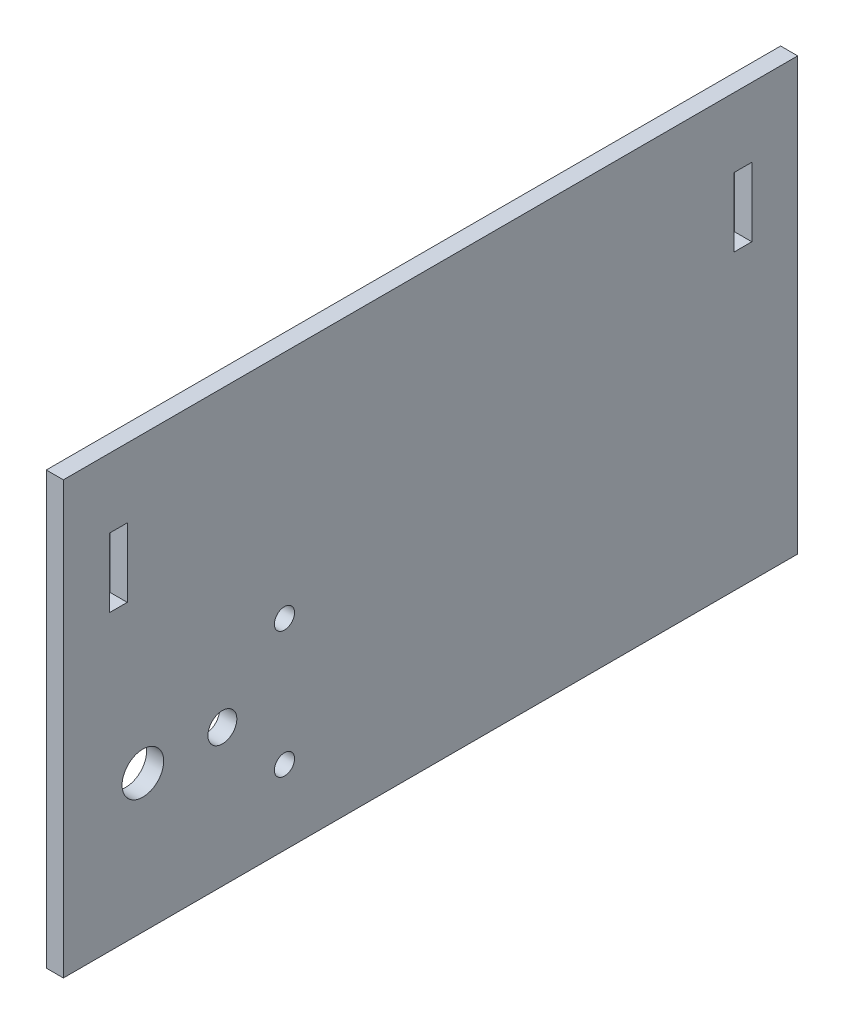
ISO-10303-21;
HEADER;
FILE_DESCRIPTION(('STEP AP214'),'2;1');
FILE_NAME('part.step','',(''),(''),'','','');
FILE_SCHEMA(('AUTOMOTIVE_DESIGN { 1 0 10303 214 1 1 1 1 }'));
ENDSEC;
DATA;
#1=APPLICATION_CONTEXT('core data for automotive mechanical design processes');
#2=APPLICATION_PROTOCOL_DEFINITION('international standard','automotive_design',2000,#1);
#3=PRODUCT_CONTEXT('',#1,'mechanical');
#4=PRODUCT('Part','Part','',(#3));
#5=PRODUCT_RELATED_PRODUCT_CATEGORY('part','',(#4));
#6=PRODUCT_DEFINITION_FORMATION('','',#4);
#7=PRODUCT_DEFINITION_CONTEXT('part definition',#1,'design');
#8=PRODUCT_DEFINITION('design','',#6,#7);
#9=PRODUCT_DEFINITION_SHAPE('','',#8);
#10=(LENGTH_UNIT() NAMED_UNIT(*) SI_UNIT(.MILLI.,.METRE.));
#11=(NAMED_UNIT(*) PLANE_ANGLE_UNIT() SI_UNIT($,.RADIAN.));
#12=(NAMED_UNIT(*) SI_UNIT($,.STERADIAN.) SOLID_ANGLE_UNIT());
#13=UNCERTAINTY_MEASURE_WITH_UNIT(LENGTH_MEASURE(1.E-05),#10,'distance_accuracy_value','');
#14=(GEOMETRIC_REPRESENTATION_CONTEXT(3) GLOBAL_UNCERTAINTY_ASSIGNED_CONTEXT((#13)) GLOBAL_UNIT_ASSIGNED_CONTEXT((#10,
#11,#12)) REPRESENTATION_CONTEXT('',''));
#15=CARTESIAN_POINT('',(0.,0.,0.));
#16=DIRECTION('',(0.,0.,1.));
#17=DIRECTION('',(1.,0.,0.));
#18=AXIS2_PLACEMENT_3D('',#15,#16,#17);
#19=CARTESIAN_POINT('',(2.3622,0.,0.));
#20=DIRECTION('',(0.,0.,-1.));
#21=DIRECTION('',(-1.,0.,0.));
#22=AXIS2_PLACEMENT_3D('',#19,#20,#21);
#23=PLANE('',#22);
#24=DIRECTION('',(0.,-1.,0.));
#25=VECTOR('',#24,1.);
#26=CARTESIAN_POINT('',(0.,0.,0.));
#27=LINE('',#26,#25);
#28=CARTESIAN_POINT('',(0.,59.69,0.));
#29=VERTEX_POINT('',#28);
#30=CARTESIAN_POINT('',(0.,0.,0.));
#31=VERTEX_POINT('',#30);
#32=EDGE_CURVE('E213',#29,#31,#27,.T.);
#33=ORIENTED_EDGE('',*,*,#32,.T.);
#34=DIRECTION('',(-1.,0.,0.));
#35=VECTOR('',#34,1.);
#36=CARTESIAN_POINT('',(2.3622,0.,0.));
#37=LINE('',#36,#35);
#38=CARTESIAN_POINT('',(2.3622,0.,0.));
#39=VERTEX_POINT('',#38);
#40=EDGE_CURVE('E11',#39,#31,#37,.T.);
#41=ORIENTED_EDGE('',*,*,#40,.F.);
#42=DIRECTION('',(0.,-1.,0.));
#43=VECTOR('',#42,1.);
#44=CARTESIAN_POINT('',(2.3622,0.,0.));
#45=LINE('',#44,#43);
#46=CARTESIAN_POINT('',(2.3622,59.69,0.));
#47=VERTEX_POINT('',#46);
#48=EDGE_CURVE('E216',#47,#39,#45,.T.);
#49=ORIENTED_EDGE('',*,*,#48,.F.);
#50=DIRECTION('',(-1.,0.,0.));
#51=VECTOR('',#50,1.);
#52=CARTESIAN_POINT('',(2.3622,59.69,0.));
#53=LINE('',#52,#51);
#54=EDGE_CURVE('E226',#47,#29,#53,.T.);
#55=ORIENTED_EDGE('',*,*,#54,.T.);
#56=EDGE_LOOP('',(#33,#41,#49,#55));
#57=FACE_BOUND('',#56,.T.);
#58=ADVANCED_FACE('F35',(#57),#23,.F.);
#59=CARTESIAN_POINT('',(2.3622,0.,0.));
#60=DIRECTION('',(0.,1.,0.));
#61=DIRECTION('',(0.,0.,1.));
#62=AXIS2_PLACEMENT_3D('',#59,#60,#61);
#63=PLANE('',#62);
#64=DIRECTION('',(0.,0.,-1.));
#65=VECTOR('',#64,1.);
#66=CARTESIAN_POINT('',(0.,0.,0.));
#67=LINE('',#66,#65);
#68=CARTESIAN_POINT('',(0.,0.,-101.6));
#69=VERTEX_POINT('',#68);
#70=EDGE_CURVE('E229',#31,#69,#67,.T.);
#71=ORIENTED_EDGE('',*,*,#70,.T.);
#72=DIRECTION('',(-1.,0.,0.));
#73=VECTOR('',#72,1.);
#74=CARTESIAN_POINT('',(2.3622,0.,-101.6));
#75=LINE('',#74,#73);
#76=CARTESIAN_POINT('',(2.3622,0.,-101.6));
#77=VERTEX_POINT('',#76);
#78=EDGE_CURVE('E42',#77,#69,#75,.T.);
#79=ORIENTED_EDGE('',*,*,#78,.F.);
#80=DIRECTION('',(0.,0.,-1.));
#81=VECTOR('',#80,1.);
#82=CARTESIAN_POINT('',(2.3622,0.,0.));
#83=LINE('',#82,#81);
#84=EDGE_CURVE('E219',#39,#77,#83,.T.);
#85=ORIENTED_EDGE('',*,*,#84,.F.);
#86=ORIENTED_EDGE('',*,*,#40,.T.);
#87=EDGE_LOOP('',(#71,#79,#85,#86));
#88=FACE_BOUND('',#87,.T.);
#89=ADVANCED_FACE('F258',(#88),#63,.F.);
#90=CARTESIAN_POINT('',(2.3622,0.,-101.6));
#91=DIRECTION('',(0.,0.,1.));
#92=DIRECTION('',(1.,0.,0.));
#93=AXIS2_PLACEMENT_3D('',#90,#91,#92);
#94=PLANE('',#93);
#95=DIRECTION('',(0.,1.,0.));
#96=VECTOR('',#95,1.);
#97=CARTESIAN_POINT('',(0.,0.,-101.6));
#98=LINE('',#97,#96);
#99=CARTESIAN_POINT('',(0.,59.69,-101.6));
#100=VERTEX_POINT('',#99);
#101=EDGE_CURVE('E231',#69,#100,#98,.T.);
#102=ORIENTED_EDGE('',*,*,#101,.T.);
#103=DIRECTION('',(-1.,0.,0.));
#104=VECTOR('',#103,1.);
#105=CARTESIAN_POINT('',(2.3622,59.69,-101.6));
#106=LINE('',#105,#104);
#107=CARTESIAN_POINT('',(2.3622,59.69,-101.6));
#108=VERTEX_POINT('',#107);
#109=EDGE_CURVE('E236',#108,#100,#106,.T.);
#110=ORIENTED_EDGE('',*,*,#109,.F.);
#111=DIRECTION('',(0.,1.,0.));
#112=VECTOR('',#111,1.);
#113=CARTESIAN_POINT('',(2.3622,0.,-101.6));
#114=LINE('',#113,#112);
#115=EDGE_CURVE('E222',#77,#108,#114,.T.);
#116=ORIENTED_EDGE('',*,*,#115,.F.);
#117=ORIENTED_EDGE('',*,*,#78,.T.);
#118=EDGE_LOOP('',(#102,#110,#116,#117));
#119=FACE_BOUND('',#118,.T.);
#120=ADVANCED_FACE('F243',(#119),#94,.F.);
#121=CARTESIAN_POINT('',(2.3622,59.69,0.));
#122=DIRECTION('',(0.,-1.,0.));
#123=DIRECTION('',(0.,0.,-1.));
#124=AXIS2_PLACEMENT_3D('',#121,#122,#123);
#125=PLANE('',#124);
#126=DIRECTION('',(0.,0.,1.));
#127=VECTOR('',#126,1.);
#128=CARTESIAN_POINT('',(0.,59.69,0.));
#129=LINE('',#128,#127);
#130=EDGE_CURVE('E220',#100,#29,#129,.T.);
#131=ORIENTED_EDGE('',*,*,#130,.T.);
#132=ORIENTED_EDGE('',*,*,#54,.F.);
#133=DIRECTION('',(0.,0.,1.));
#134=VECTOR('',#133,1.);
#135=CARTESIAN_POINT('',(2.3622,59.69,0.));
#136=LINE('',#135,#134);
#137=EDGE_CURVE('E224',#108,#47,#136,.T.);
#138=ORIENTED_EDGE('',*,*,#137,.F.);
#139=ORIENTED_EDGE('',*,*,#109,.T.);
#140=EDGE_LOOP('',(#131,#132,#138,#139));
#141=FACE_BOUND('',#140,.T.);
#142=ADVANCED_FACE('F251',(#141),#125,.F.);
#143=CARTESIAN_POINT('',(2.3622,0.,0.));
#144=DIRECTION('',(-1.,0.,0.));
#145=DIRECTION('',(0.,0.,1.));
#146=AXIS2_PLACEMENT_3D('',#143,#144,#145);
#147=PLANE('',#146);
#148=DIRECTION('',(0.,-1.,0.));
#149=VECTOR('',#148,1.);
#150=CARTESIAN_POINT('',(2.3622,50.1142,-92.7608));
#151=LINE('',#150,#149);
#152=CARTESIAN_POINT('',(2.3622,50.1142,-92.7608));
#153=VERTEX_POINT('',#152);
#154=CARTESIAN_POINT('',(2.3622,40.5892,-92.7608));
#155=VERTEX_POINT('',#154);
#156=EDGE_CURVE('E150',#153,#155,#151,.T.);
#157=ORIENTED_EDGE('',*,*,#156,.F.);
#158=DIRECTION('',(0.,0.,1.));
#159=VECTOR('',#158,1.);
#160=CARTESIAN_POINT('',(2.3622,50.1142,-95.25));
#161=LINE('',#160,#159);
#162=CARTESIAN_POINT('',(2.3622,50.1142,-95.25));
#163=VERTEX_POINT('',#162);
#164=EDGE_CURVE('E49',#163,#153,#161,.T.);
#165=ORIENTED_EDGE('',*,*,#164,.F.);
#166=DIRECTION('',(0.,1.,0.));
#167=VECTOR('',#166,1.);
#168=CARTESIAN_POINT('',(2.3622,50.1142,-95.25));
#169=LINE('',#168,#167);
#170=CARTESIAN_POINT('',(2.3622,40.5892,-95.25));
#171=VERTEX_POINT('',#170);
#172=EDGE_CURVE('E141',#171,#163,#169,.T.);
#173=ORIENTED_EDGE('',*,*,#172,.F.);
#174=DIRECTION('',(0.,0.,-1.));
#175=VECTOR('',#174,1.);
#176=CARTESIAN_POINT('',(2.3622,40.5892,-95.25));
#177=LINE('',#176,#175);
#178=EDGE_CURVE('E144',#155,#171,#177,.T.);
#179=ORIENTED_EDGE('',*,*,#178,.F.);
#180=EDGE_LOOP('',(#157,#165,#173,#179));
#181=FACE_BOUND('',#180,.T.);
#182=DIRECTION('',(0.,0.,-1.));
#183=VECTOR('',#182,1.);
#184=CARTESIAN_POINT('',(2.3622,40.5892,-6.35));
#185=LINE('',#184,#183);
#186=CARTESIAN_POINT('',(2.3622,40.5892,-6.35));
#187=VERTEX_POINT('',#186);
#188=CARTESIAN_POINT('',(2.3622,40.5892,-8.8392));
#189=VERTEX_POINT('',#188);
#190=EDGE_CURVE('E175',#187,#189,#185,.T.);
#191=ORIENTED_EDGE('',*,*,#190,.F.);
#192=DIRECTION('',(0.,-1.,0.));
#193=VECTOR('',#192,1.);
#194=CARTESIAN_POINT('',(2.3622,50.1142,-6.35));
#195=LINE('',#194,#193);
#196=CARTESIAN_POINT('',(2.3622,50.1142,-6.35));
#197=VERTEX_POINT('',#196);
#198=EDGE_CURVE('E156',#197,#187,#195,.T.);
#199=ORIENTED_EDGE('',*,*,#198,.F.);
#200=DIRECTION('',(0.,0.,1.));
#201=VECTOR('',#200,1.);
#202=CARTESIAN_POINT('',(2.3622,50.1142,-6.35));
#203=LINE('',#202,#201);
#204=CARTESIAN_POINT('',(2.3622,50.1142,-8.8392));
#205=VERTEX_POINT('',#204);
#206=EDGE_CURVE('E164',#205,#197,#203,.T.);
#207=ORIENTED_EDGE('',*,*,#206,.F.);
#208=DIRECTION('',(0.,1.,0.));
#209=VECTOR('',#208,1.);
#210=CARTESIAN_POINT('',(2.3622,50.1142,-8.8392));
#211=LINE('',#210,#209);
#212=EDGE_CURVE('E178',#189,#205,#211,.T.);
#213=ORIENTED_EDGE('',*,*,#212,.F.);
#214=EDGE_LOOP('',(#191,#199,#207,#213));
#215=FACE_BOUND('',#214,.T.);
#216=CARTESIAN_POINT('',(2.3622,19.05,-11.));
#217=DIRECTION('',(1.,0.,0.));
#218=DIRECTION('',(0.,0.,1.));
#219=AXIS2_PLACEMENT_3D('',#216,#217,#218);
#220=CIRCLE('',#219,2.87699996099999);
#221=CARTESIAN_POINT('',(2.3622,19.05,-8.12300003899999));
#222=VERTEX_POINT('',#221);
#223=EDGE_CURVE('E192',#222,#222,#220,.T.);
#224=ORIENTED_EDGE('',*,*,#223,.F.);
#225=EDGE_LOOP('',(#224));
#226=FACE_BOUND('',#225,.T.);
#227=CARTESIAN_POINT('',(2.3622,19.05,-22.0000034));
#228=DIRECTION('',(1.,0.,0.));
#229=DIRECTION('',(0.,0.,1.));
#230=AXIS2_PLACEMENT_3D('',#227,#228,#229);
#231=CIRCLE('',#230,1.99999999999998);
#232=CARTESIAN_POINT('',(2.3622,19.05,-20.0000034));
#233=VERTEX_POINT('',#232);
#234=EDGE_CURVE('E198',#233,#233,#231,.T.);
#235=ORIENTED_EDGE('',*,*,#234,.F.);
#236=EDGE_LOOP('',(#235));
#237=FACE_BOUND('',#236,.T.);
#238=CARTESIAN_POINT('',(2.3622,27.8,-30.59102));
#239=DIRECTION('',(1.,0.,0.));
#240=DIRECTION('',(0.,0.,1.));
#241=AXIS2_PLACEMENT_3D('',#238,#239,#240);
#242=CIRCLE('',#241,1.39999999999999);
#243=CARTESIAN_POINT('',(2.3622,27.8,-29.19102));
#244=VERTEX_POINT('',#243);
#245=EDGE_CURVE('E204',#244,#244,#242,.T.);
#246=ORIENTED_EDGE('',*,*,#245,.F.);
#247=EDGE_LOOP('',(#246));
#248=FACE_BOUND('',#247,.T.);
#249=CARTESIAN_POINT('',(2.3622,10.3,-30.59102));
#250=DIRECTION('',(1.,0.,0.));
#251=DIRECTION('',(0.,0.,1.));
#252=AXIS2_PLACEMENT_3D('',#249,#250,#251);
#253=CIRCLE('',#252,1.39999999999999);
#254=CARTESIAN_POINT('',(2.3622,10.3,-29.19102));
#255=VERTEX_POINT('',#254);
#256=EDGE_CURVE('E210',#255,#255,#253,.T.);
#257=ORIENTED_EDGE('',*,*,#256,.F.);
#258=EDGE_LOOP('',(#257));
#259=FACE_BOUND('',#258,.T.);
#260=ORIENTED_EDGE('',*,*,#48,.T.);
#261=ORIENTED_EDGE('',*,*,#84,.T.);
#262=ORIENTED_EDGE('',*,*,#115,.T.);
#263=ORIENTED_EDGE('',*,*,#137,.T.);
#264=EDGE_LOOP('',(#260,#261,#262,#263));
#265=FACE_BOUND('',#264,.T.);
#266=ADVANCED_FACE('F257',(#181,#215,#226,#237,#248,#259,#265),#147,.F.);
#267=CARTESIAN_POINT('',(0.,0.,0.));
#268=DIRECTION('',(-1.,0.,0.));
#269=DIRECTION('',(0.,0.,1.));
#270=AXIS2_PLACEMENT_3D('',#267,#268,#269);
#271=PLANE('',#270);
#272=DIRECTION('',(0.,0.,1.));
#273=VECTOR('',#272,1.);
#274=CARTESIAN_POINT('',(0.,50.1142,-95.25));
#275=LINE('',#274,#273);
#276=CARTESIAN_POINT('',(0.,50.1142,-95.25));
#277=VERTEX_POINT('',#276);
#278=CARTESIAN_POINT('',(0.,50.1142,-92.7608));
#279=VERTEX_POINT('',#278);
#280=EDGE_CURVE('E125',#277,#279,#275,.T.);
#281=ORIENTED_EDGE('',*,*,#280,.T.);
#282=DIRECTION('',(0.,-1.,0.));
#283=VECTOR('',#282,1.);
#284=CARTESIAN_POINT('',(0.,50.1142,-92.7608));
#285=LINE('',#284,#283);
#286=CARTESIAN_POINT('',(0.,40.5892,-92.7608));
#287=VERTEX_POINT('',#286);
#288=EDGE_CURVE('E134',#279,#287,#285,.T.);
#289=ORIENTED_EDGE('',*,*,#288,.T.);
#290=DIRECTION('',(0.,0.,-1.));
#291=VECTOR('',#290,1.);
#292=CARTESIAN_POINT('',(0.,40.5892,-95.25));
#293=LINE('',#292,#291);
#294=CARTESIAN_POINT('',(0.,40.5892,-95.25));
#295=VERTEX_POINT('',#294);
#296=EDGE_CURVE('E57',#287,#295,#293,.T.);
#297=ORIENTED_EDGE('',*,*,#296,.T.);
#298=DIRECTION('',(0.,1.,0.));
#299=VECTOR('',#298,1.);
#300=CARTESIAN_POINT('',(0.,50.1142,-95.25));
#301=LINE('',#300,#299);
#302=EDGE_CURVE('E131',#295,#277,#301,.T.);
#303=ORIENTED_EDGE('',*,*,#302,.T.);
#304=EDGE_LOOP('',(#281,#289,#297,#303));
#305=FACE_BOUND('',#304,.T.);
#306=DIRECTION('',(0.,-1.,0.));
#307=VECTOR('',#306,1.);
#308=CARTESIAN_POINT('',(0.,50.1142,-6.35));
#309=LINE('',#308,#307);
#310=CARTESIAN_POINT('',(0.,50.1142,-6.35));
#311=VERTEX_POINT('',#310);
#312=CARTESIAN_POINT('',(0.,40.5892,-6.35));
#313=VERTEX_POINT('',#312);
#314=EDGE_CURVE('E160',#311,#313,#309,.T.);
#315=ORIENTED_EDGE('',*,*,#314,.T.);
#316=DIRECTION('',(0.,0.,-1.));
#317=VECTOR('',#316,1.);
#318=CARTESIAN_POINT('',(0.,40.5892,-6.35));
#319=LINE('',#318,#317);
#320=CARTESIAN_POINT('',(0.,40.5892,-8.8392));
#321=VERTEX_POINT('',#320);
#322=EDGE_CURVE('E163',#313,#321,#319,.T.);
#323=ORIENTED_EDGE('',*,*,#322,.T.);
#324=DIRECTION('',(0.,1.,0.));
#325=VECTOR('',#324,1.);
#326=CARTESIAN_POINT('',(0.,50.1142,-8.8392));
#327=LINE('',#326,#325);
#328=CARTESIAN_POINT('',(0.,50.1142,-8.8392));
#329=VERTEX_POINT('',#328);
#330=EDGE_CURVE('E167',#321,#329,#327,.T.);
#331=ORIENTED_EDGE('',*,*,#330,.T.);
#332=DIRECTION('',(0.,0.,1.));
#333=VECTOR('',#332,1.);
#334=CARTESIAN_POINT('',(0.,50.1142,-6.35));
#335=LINE('',#334,#333);
#336=EDGE_CURVE('E170',#329,#311,#335,.T.);
#337=ORIENTED_EDGE('',*,*,#336,.T.);
#338=EDGE_LOOP('',(#315,#323,#331,#337));
#339=FACE_BOUND('',#338,.T.);
#340=CARTESIAN_POINT('',(0.,19.05,-11.));
#341=DIRECTION('',(-1.,0.,0.));
#342=DIRECTION('',(0.,0.,1.));
#343=AXIS2_PLACEMENT_3D('',#340,#341,#342);
#344=CIRCLE('',#343,2.87699996099999);
#345=CARTESIAN_POINT('',(0.,19.05,-8.12300003899999));
#346=VERTEX_POINT('',#345);
#347=EDGE_CURVE('E185',#346,#346,#344,.F.);
#348=ORIENTED_EDGE('',*,*,#347,.T.);
#349=EDGE_LOOP('',(#348));
#350=FACE_BOUND('',#349,.T.);
#351=CARTESIAN_POINT('',(0.,19.05,-22.0000034));
#352=DIRECTION('',(-1.,0.,0.));
#353=DIRECTION('',(0.,0.,1.));
#354=AXIS2_PLACEMENT_3D('',#351,#352,#353);
#355=CIRCLE('',#354,1.99999999999998);
#356=CARTESIAN_POINT('',(0.,19.05,-20.0000034));
#357=VERTEX_POINT('',#356);
#358=EDGE_CURVE('E195',#357,#357,#355,.F.);
#359=ORIENTED_EDGE('',*,*,#358,.T.);
#360=EDGE_LOOP('',(#359));
#361=FACE_BOUND('',#360,.T.);
#362=CARTESIAN_POINT('',(0.,27.8,-30.59102));
#363=DIRECTION('',(-1.,0.,0.));
#364=DIRECTION('',(0.,0.,1.));
#365=AXIS2_PLACEMENT_3D('',#362,#363,#364);
#366=CIRCLE('',#365,1.39999999999999);
#367=CARTESIAN_POINT('',(0.,27.8,-29.19102));
#368=VERTEX_POINT('',#367);
#369=EDGE_CURVE('E201',#368,#368,#366,.F.);
#370=ORIENTED_EDGE('',*,*,#369,.T.);
#371=EDGE_LOOP('',(#370));
#372=FACE_BOUND('',#371,.T.);
#373=CARTESIAN_POINT('',(0.,10.3,-30.59102));
#374=DIRECTION('',(-1.,0.,0.));
#375=DIRECTION('',(0.,0.,1.));
#376=AXIS2_PLACEMENT_3D('',#373,#374,#375);
#377=CIRCLE('',#376,1.39999999999999);
#378=CARTESIAN_POINT('',(0.,10.3,-29.19102));
#379=VERTEX_POINT('',#378);
#380=EDGE_CURVE('E207',#379,#379,#377,.F.);
#381=ORIENTED_EDGE('',*,*,#380,.T.);
#382=EDGE_LOOP('',(#381));
#383=FACE_BOUND('',#382,.T.);
#384=ORIENTED_EDGE('',*,*,#32,.F.);
#385=ORIENTED_EDGE('',*,*,#130,.F.);
#386=ORIENTED_EDGE('',*,*,#101,.F.);
#387=ORIENTED_EDGE('',*,*,#70,.F.);
#388=EDGE_LOOP('',(#384,#385,#386,#387));
#389=FACE_BOUND('',#388,.T.);
#390=ADVANCED_FACE('F138',(#305,#339,#350,#361,#372,#383,#389),#271,.T.);
#391=CARTESIAN_POINT('',(-0.00100000000000013,10.3,-30.59102));
#392=DIRECTION('',(1.,0.,0.));
#393=DIRECTION('',(0.,0.,-1.));
#394=AXIS2_PLACEMENT_3D('',#391,#392,#393);
#395=CYLINDRICAL_SURFACE('',#394,1.39999999999999);
#396=ORIENTED_EDGE('',*,*,#380,.F.);
#397=EDGE_LOOP('',(#396));
#398=FACE_BOUND('',#397,.T.);
#399=ORIENTED_EDGE('',*,*,#256,.T.);
#400=EDGE_LOOP('',(#399));
#401=FACE_BOUND('',#400,.T.);
#402=ADVANCED_FACE('F270',(#398,#401),#395,.F.);
#403=CARTESIAN_POINT('',(-0.00100000000000013,27.8,-30.59102));
#404=DIRECTION('',(1.,0.,0.));
#405=DIRECTION('',(0.,0.,-1.));
#406=AXIS2_PLACEMENT_3D('',#403,#404,#405);
#407=CYLINDRICAL_SURFACE('',#406,1.39999999999999);
#408=ORIENTED_EDGE('',*,*,#369,.F.);
#409=EDGE_LOOP('',(#408));
#410=FACE_BOUND('',#409,.T.);
#411=ORIENTED_EDGE('',*,*,#245,.T.);
#412=EDGE_LOOP('',(#411));
#413=FACE_BOUND('',#412,.T.);
#414=ADVANCED_FACE('F276',(#410,#413),#407,.F.);
#415=CARTESIAN_POINT('',(-0.00100000000000013,19.05,-22.0000034));
#416=DIRECTION('',(1.,0.,0.));
#417=DIRECTION('',(0.,0.,-1.));
#418=AXIS2_PLACEMENT_3D('',#415,#416,#417);
#419=CYLINDRICAL_SURFACE('',#418,1.99999999999998);
#420=ORIENTED_EDGE('',*,*,#358,.F.);
#421=EDGE_LOOP('',(#420));
#422=FACE_BOUND('',#421,.T.);
#423=ORIENTED_EDGE('',*,*,#234,.T.);
#424=EDGE_LOOP('',(#423));
#425=FACE_BOUND('',#424,.T.);
#426=ADVANCED_FACE('F280',(#422,#425),#419,.F.);
#427=CARTESIAN_POINT('',(-0.00100000000000013,19.05,-11.));
#428=DIRECTION('',(1.,0.,0.));
#429=DIRECTION('',(0.,0.,-1.));
#430=AXIS2_PLACEMENT_3D('',#427,#428,#429);
#431=CYLINDRICAL_SURFACE('',#430,2.87699996099999);
#432=ORIENTED_EDGE('',*,*,#347,.F.);
#433=EDGE_LOOP('',(#432));
#434=FACE_BOUND('',#433,.T.);
#435=ORIENTED_EDGE('',*,*,#223,.T.);
#436=EDGE_LOOP('',(#435));
#437=FACE_BOUND('',#436,.T.);
#438=ADVANCED_FACE('F284',(#434,#437),#431,.F.);
#439=CARTESIAN_POINT('',(0.,50.1142,-6.35));
#440=DIRECTION('',(0.,0.,1.));
#441=DIRECTION('',(0.,-1.,0.));
#442=AXIS2_PLACEMENT_3D('',#439,#440,#441);
#443=PLANE('',#442);
#444=ORIENTED_EDGE('',*,*,#198,.T.);
#445=DIRECTION('',(1.,0.,0.));
#446=VECTOR('',#445,1.);
#447=CARTESIAN_POINT('',(0.,40.5892,-6.35));
#448=LINE('',#447,#446);
#449=EDGE_CURVE('E173',#313,#187,#448,.T.);
#450=ORIENTED_EDGE('',*,*,#449,.F.);
#451=ORIENTED_EDGE('',*,*,#314,.F.);
#452=DIRECTION('',(1.,0.,0.));
#453=VECTOR('',#452,1.);
#454=CARTESIAN_POINT('',(0.,50.1142,-6.35));
#455=LINE('',#454,#453);
#456=EDGE_CURVE('E183',#311,#197,#455,.T.);
#457=ORIENTED_EDGE('',*,*,#456,.T.);
#458=EDGE_LOOP('',(#444,#450,#451,#457));
#459=FACE_BOUND('',#458,.T.);
#460=ADVANCED_FACE('F288',(#459),#443,.F.);
#461=CARTESIAN_POINT('',(0.,50.1142,-6.35));
#462=DIRECTION('',(0.,1.,0.));
#463=DIRECTION('',(0.,0.,1.));
#464=AXIS2_PLACEMENT_3D('',#461,#462,#463);
#465=PLANE('',#464);
#466=ORIENTED_EDGE('',*,*,#206,.T.);
#467=ORIENTED_EDGE('',*,*,#456,.F.);
#468=ORIENTED_EDGE('',*,*,#336,.F.);
#469=DIRECTION('',(1.,0.,0.));
#470=VECTOR('',#469,1.);
#471=CARTESIAN_POINT('',(0.,50.1142,-8.8392));
#472=LINE('',#471,#470);
#473=EDGE_CURVE('E186',#329,#205,#472,.T.);
#474=ORIENTED_EDGE('',*,*,#473,.T.);
#475=EDGE_LOOP('',(#466,#467,#468,#474));
#476=FACE_BOUND('',#475,.T.);
#477=ADVANCED_FACE('F292',(#476),#465,.F.);
#478=CARTESIAN_POINT('',(0.,50.1142,-8.8392));
#479=DIRECTION('',(0.,0.,-1.));
#480=DIRECTION('',(0.,1.,0.));
#481=AXIS2_PLACEMENT_3D('',#478,#479,#480);
#482=PLANE('',#481);
#483=ORIENTED_EDGE('',*,*,#212,.T.);
#484=ORIENTED_EDGE('',*,*,#473,.F.);
#485=ORIENTED_EDGE('',*,*,#330,.F.);
#486=DIRECTION('',(1.,0.,0.));
#487=VECTOR('',#486,1.);
#488=CARTESIAN_POINT('',(0.,40.5892,-8.8392));
#489=LINE('',#488,#487);
#490=EDGE_CURVE('E188',#321,#189,#489,.T.);
#491=ORIENTED_EDGE('',*,*,#490,.T.);
#492=EDGE_LOOP('',(#483,#484,#485,#491));
#493=FACE_BOUND('',#492,.T.);
#494=ADVANCED_FACE('F297',(#493),#482,.F.);
#495=CARTESIAN_POINT('',(0.,40.5892,-6.35));
#496=DIRECTION('',(0.,-1.,0.));
#497=DIRECTION('',(0.,0.,-1.));
#498=AXIS2_PLACEMENT_3D('',#495,#496,#497);
#499=PLANE('',#498);
#500=ORIENTED_EDGE('',*,*,#190,.T.);
#501=ORIENTED_EDGE('',*,*,#490,.F.);
#502=ORIENTED_EDGE('',*,*,#322,.F.);
#503=ORIENTED_EDGE('',*,*,#449,.T.);
#504=EDGE_LOOP('',(#500,#501,#502,#503));
#505=FACE_BOUND('',#504,.T.);
#506=ADVANCED_FACE('F294',(#505),#499,.F.);
#507=CARTESIAN_POINT('',(0.,50.1142,-95.25));
#508=DIRECTION('',(0.,1.,0.));
#509=DIRECTION('',(0.,0.,1.));
#510=AXIS2_PLACEMENT_3D('',#507,#508,#509);
#511=PLANE('',#510);
#512=ORIENTED_EDGE('',*,*,#164,.T.);
#513=DIRECTION('',(1.,0.,0.));
#514=VECTOR('',#513,1.);
#515=CARTESIAN_POINT('',(0.,50.1142,-92.7608));
#516=LINE('',#515,#514);
#517=EDGE_CURVE('E121',#279,#153,#516,.T.);
#518=ORIENTED_EDGE('',*,*,#517,.F.);
#519=ORIENTED_EDGE('',*,*,#280,.F.);
#520=DIRECTION('',(1.,0.,0.));
#521=VECTOR('',#520,1.);
#522=CARTESIAN_POINT('',(0.,50.1142,-95.25));
#523=LINE('',#522,#521);
#524=EDGE_CURVE('E154',#277,#163,#523,.T.);
#525=ORIENTED_EDGE('',*,*,#524,.T.);
#526=EDGE_LOOP('',(#512,#518,#519,#525));
#527=FACE_BOUND('',#526,.T.);
#528=ADVANCED_FACE('F123',(#527),#511,.F.);
#529=CARTESIAN_POINT('',(0.,50.1142,-95.25));
#530=DIRECTION('',(0.,0.,-1.));
#531=DIRECTION('',(-1.,0.,0.));
#532=AXIS2_PLACEMENT_3D('',#529,#530,#531);
#533=PLANE('',#532);
#534=ORIENTED_EDGE('',*,*,#172,.T.);
#535=ORIENTED_EDGE('',*,*,#524,.F.);
#536=ORIENTED_EDGE('',*,*,#302,.F.);
#537=DIRECTION('',(1.,0.,0.));
#538=VECTOR('',#537,1.);
#539=CARTESIAN_POINT('',(0.,40.5892,-95.25));
#540=LINE('',#539,#538);
#541=EDGE_CURVE('E157',#295,#171,#540,.T.);
#542=ORIENTED_EDGE('',*,*,#541,.T.);
#543=EDGE_LOOP('',(#534,#535,#536,#542));
#544=FACE_BOUND('',#543,.T.);
#545=ADVANCED_FACE('F307',(#544),#533,.F.);
#546=CARTESIAN_POINT('',(0.,40.5892,-95.25));
#547=DIRECTION('',(0.,-1.,0.));
#548=DIRECTION('',(0.,0.,-1.));
#549=AXIS2_PLACEMENT_3D('',#546,#547,#548);
#550=PLANE('',#549);
#551=ORIENTED_EDGE('',*,*,#178,.T.);
#552=ORIENTED_EDGE('',*,*,#541,.F.);
#553=ORIENTED_EDGE('',*,*,#296,.F.);
#554=DIRECTION('',(1.,0.,0.));
#555=VECTOR('',#554,1.);
#556=CARTESIAN_POINT('',(0.,40.5892,-92.7608));
#557=LINE('',#556,#555);
#558=EDGE_CURVE('E130',#287,#155,#557,.T.);
#559=ORIENTED_EDGE('',*,*,#558,.T.);
#560=EDGE_LOOP('',(#551,#552,#553,#559));
#561=FACE_BOUND('',#560,.T.);
#562=ADVANCED_FACE('F310',(#561),#550,.F.);
#563=CARTESIAN_POINT('',(0.,50.1142,-92.7608));
#564=DIRECTION('',(0.,0.,1.));
#565=DIRECTION('',(1.,0.,0.));
#566=AXIS2_PLACEMENT_3D('',#563,#564,#565);
#567=PLANE('',#566);
#568=ORIENTED_EDGE('',*,*,#156,.T.);
#569=ORIENTED_EDGE('',*,*,#558,.F.);
#570=ORIENTED_EDGE('',*,*,#288,.F.);
#571=ORIENTED_EDGE('',*,*,#517,.T.);
#572=EDGE_LOOP('',(#568,#569,#570,#571));
#573=FACE_BOUND('',#572,.T.);
#574=ADVANCED_FACE('F135',(#573),#567,.F.);
#575=CLOSED_SHELL('',(#58,#89,#120,#142,#266,#390,#402,#414,#426,#438,#460,#477,#494,#506,#528,
#545,#562,#574));
#576=MANIFOLD_SOLID_BREP('B2',#575);
#577=ADVANCED_BREP_SHAPE_REPRESENTATION('',(#18,#576),#14);
#578=SHAPE_DEFINITION_REPRESENTATION(#9,#577);
ENDSEC;
END-ISO-10303-21;
